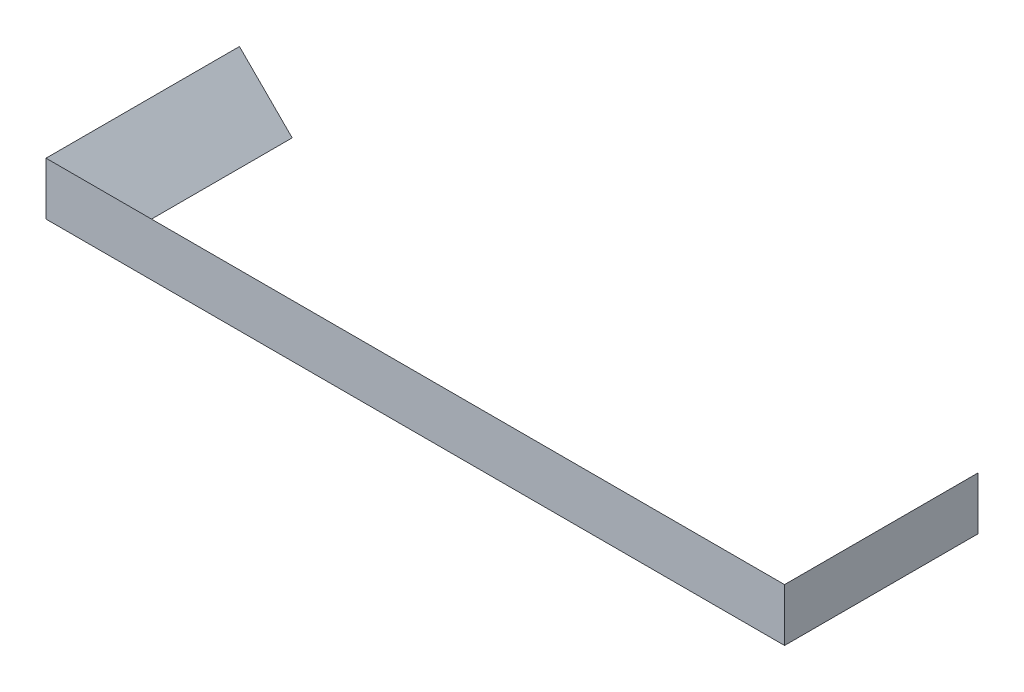
ISO-10303-21;
HEADER;
FILE_DESCRIPTION(('STEP AP214'),'2;1');
FILE_NAME('part.step','',(''),(''),'','','');
FILE_SCHEMA(('AUTOMOTIVE_DESIGN { 1 0 10303 214 1 1 1 1 }'));
ENDSEC;
DATA;
#1=APPLICATION_CONTEXT('core data for automotive mechanical design processes');
#2=APPLICATION_PROTOCOL_DEFINITION('international standard','automotive_design',2000,#1);
#3=PRODUCT_CONTEXT('',#1,'mechanical');
#4=PRODUCT('Part','Part','',(#3));
#5=PRODUCT_RELATED_PRODUCT_CATEGORY('part','',(#4));
#6=PRODUCT_DEFINITION_FORMATION('','',#4);
#7=PRODUCT_DEFINITION_CONTEXT('part definition',#1,'design');
#8=PRODUCT_DEFINITION('design','',#6,#7);
#9=PRODUCT_DEFINITION_SHAPE('','',#8);
#10=(LENGTH_UNIT() NAMED_UNIT(*) SI_UNIT(.MILLI.,.METRE.));
#11=(NAMED_UNIT(*) PLANE_ANGLE_UNIT() SI_UNIT($,.RADIAN.));
#12=(NAMED_UNIT(*) SI_UNIT($,.STERADIAN.) SOLID_ANGLE_UNIT());
#13=UNCERTAINTY_MEASURE_WITH_UNIT(LENGTH_MEASURE(1.E-05),#10,'distance_accuracy_value','');
#14=(GEOMETRIC_REPRESENTATION_CONTEXT(3) GLOBAL_UNCERTAINTY_ASSIGNED_CONTEXT((#13)) GLOBAL_UNIT_ASSIGNED_CONTEXT((#10,
#11,#12)) REPRESENTATION_CONTEXT('',''));
#15=CARTESIAN_POINT('',(0.,0.,0.));
#16=DIRECTION('',(0.,0.,1.));
#17=DIRECTION('',(1.,0.,0.));
#18=AXIS2_PLACEMENT_3D('',#15,#16,#17);
#19=CARTESIAN_POINT('',(84.,0.,22.));
#20=DIRECTION('',(-1.,0.,0.));
#21=DIRECTION('',(0.,0.,1.));
#22=AXIS2_PLACEMENT_3D('',#19,#20,#21);
#23=PLANE('',#22);
#24=DIRECTION('',(0.,-1.,0.));
#25=VECTOR('',#24,1.);
#26=CARTESIAN_POINT('',(84.,0.,0.));
#27=LINE('',#26,#25);
#28=CARTESIAN_POINT('',(84.,6.,0.));
#29=VERTEX_POINT('',#28);
#30=CARTESIAN_POINT('',(84.,0.,0.));
#31=VERTEX_POINT('',#30);
#32=EDGE_CURVE('E54',#29,#31,#27,.T.);
#33=ORIENTED_EDGE('',*,*,#32,.F.);
#34=DIRECTION('',(0.,0.,-1.));
#35=VECTOR('',#34,1.);
#36=CARTESIAN_POINT('',(84.,5.99999999999999,22.));
#37=LINE('',#36,#35);
#38=CARTESIAN_POINT('',(84.,5.99999999999999,22.));
#39=VERTEX_POINT('',#38);
#40=EDGE_CURVE('E134',#39,#29,#37,.T.);
#41=ORIENTED_EDGE('',*,*,#40,.F.);
#42=DIRECTION('',(0.,1.,0.));
#43=VECTOR('',#42,1.);
#44=CARTESIAN_POINT('',(84.,0.,22.));
#45=LINE('',#44,#43);
#46=CARTESIAN_POINT('',(84.,0.,22.));
#47=VERTEX_POINT('',#46);
#48=EDGE_CURVE('E130',#47,#39,#45,.T.);
#49=ORIENTED_EDGE('',*,*,#48,.F.);
#50=DIRECTION('',(0.,0.,-1.));
#51=VECTOR('',#50,1.);
#52=CARTESIAN_POINT('',(84.,0.,22.));
#53=LINE('',#52,#51);
#54=EDGE_CURVE('E131',#47,#31,#53,.T.);
#55=ORIENTED_EDGE('',*,*,#54,.T.);
#56=EDGE_LOOP('',(#33,#41,#49,#55));
#57=FACE_BOUND('',#56,.T.);
#58=ADVANCED_FACE('F38',(#57),#23,.F.);
#59=CARTESIAN_POINT('',(56.6094757082487,-21.3905242917513,-5.39052429175126));
#60=DIRECTION('',(0.707106781186548,-0.707106781186547,0.));
#61=DIRECTION('',(0.707106781186547,0.707106781186548,0.));
#62=AXIS2_PLACEMENT_3D('',#59,#60,#61);
#63=PLANE('',#62);
#64=DIRECTION('',(0.707106781186547,0.707106781186548,0.));
#65=VECTOR('',#64,1.);
#66=CARTESIAN_POINT('',(56.6094757082487,-21.3905242917513,0.));
#67=LINE('',#66,#65);
#68=CARTESIAN_POINT('',(78.,0.,0.));
#69=VERTEX_POINT('',#68);
#70=EDGE_CURVE('E12',#69,#29,#67,.T.);
#71=ORIENTED_EDGE('',*,*,#70,.F.);
#72=DIRECTION('',(0.,0.,-1.));
#73=VECTOR('',#72,1.);
#74=CARTESIAN_POINT('',(78.,0.,16.));
#75=LINE('',#74,#73);
#76=CARTESIAN_POINT('',(78.,0.,16.));
#77=VERTEX_POINT('',#76);
#78=EDGE_CURVE('E137',#77,#69,#75,.T.);
#79=ORIENTED_EDGE('',*,*,#78,.F.);
#80=DIRECTION('',(-0.577350269189626,-0.577350269189626,-0.577350269189626));
#81=VECTOR('',#80,1.);
#82=CARTESIAN_POINT('',(56.6094757082487,-21.3905242917513,-5.39052429175126));
#83=LINE('',#82,#81);
#84=EDGE_CURVE('E135',#39,#77,#83,.T.);
#85=ORIENTED_EDGE('',*,*,#84,.F.);
#86=ORIENTED_EDGE('',*,*,#40,.T.);
#87=EDGE_LOOP('',(#71,#79,#85,#86));
#88=FACE_BOUND('',#87,.T.);
#89=ADVANCED_FACE('F40',(#88),#63,.F.);
#90=CARTESIAN_POINT('',(0.,0.,22.));
#91=DIRECTION('',(0.,0.,1.));
#92=DIRECTION('',(1.,0.,0.));
#93=AXIS2_PLACEMENT_3D('',#90,#91,#92);
#94=PLANE('',#93);
#95=DIRECTION('',(1.,0.,0.));
#96=VECTOR('',#95,1.);
#97=CARTESIAN_POINT('',(0.,0.,22.));
#98=LINE('',#97,#96);
#99=CARTESIAN_POINT('',(0.,0.,22.));
#100=VERTEX_POINT('',#99);
#101=EDGE_CURVE('E127',#100,#47,#98,.T.);
#102=ORIENTED_EDGE('',*,*,#101,.T.);
#103=ORIENTED_EDGE('',*,*,#48,.T.);
#104=DIRECTION('',(1.,0.,0.));
#105=VECTOR('',#104,1.);
#106=CARTESIAN_POINT('',(0.,6.,22.));
#107=LINE('',#106,#105);
#108=CARTESIAN_POINT('',(0.,6.,22.));
#109=VERTEX_POINT('',#108);
#110=EDGE_CURVE('E121',#109,#39,#107,.T.);
#111=ORIENTED_EDGE('',*,*,#110,.F.);
#112=DIRECTION('',(0.,-1.,0.));
#113=VECTOR('',#112,1.);
#114=CARTESIAN_POINT('',(0.,0.,22.));
#115=LINE('',#114,#113);
#116=EDGE_CURVE('E95',#109,#100,#115,.T.);
#117=ORIENTED_EDGE('',*,*,#116,.T.);
#118=EDGE_LOOP('',(#102,#103,#111,#117));
#119=FACE_BOUND('',#118,.T.);
#120=ADVANCED_FACE('F147',(#119),#94,.T.);
#121=CARTESIAN_POINT('',(-1.82842712474618,7.82842712474619,23.8284271247462));
#122=DIRECTION('',(0.,0.707106781186547,-0.707106781186548));
#123=DIRECTION('',(0.,0.707106781186548,0.707106781186547));
#124=AXIS2_PLACEMENT_3D('',#121,#122,#123);
#125=PLANE('',#124);
#126=ORIENTED_EDGE('',*,*,#110,.T.);
#127=ORIENTED_EDGE('',*,*,#84,.T.);
#128=DIRECTION('',(1.,0.,0.));
#129=VECTOR('',#128,1.);
#130=CARTESIAN_POINT('',(6.,0.,16.));
#131=LINE('',#130,#129);
#132=CARTESIAN_POINT('',(6.,0.,16.));
#133=VERTEX_POINT('',#132);
#134=EDGE_CURVE('E124',#133,#77,#131,.T.);
#135=ORIENTED_EDGE('',*,*,#134,.F.);
#136=DIRECTION('',(-0.577350269189626,0.577350269189626,0.577350269189626));
#137=VECTOR('',#136,1.);
#138=CARTESIAN_POINT('',(-1.82842712474618,7.82842712474619,23.8284271247462));
#139=LINE('',#138,#137);
#140=EDGE_CURVE('E118',#133,#109,#139,.T.);
#141=ORIENTED_EDGE('',*,*,#140,.T.);
#142=EDGE_LOOP('',(#126,#127,#135,#141));
#143=FACE_BOUND('',#142,.T.);
#144=ADVANCED_FACE('F152',(#143),#125,.T.);
#145=CARTESIAN_POINT('',(0.,0.,27.4852813742386));
#146=DIRECTION('',(1.,0.,0.));
#147=DIRECTION('',(0.,0.,-1.));
#148=AXIS2_PLACEMENT_3D('',#145,#146,#147);
#149=PLANE('',#148);
#150=ORIENTED_EDGE('',*,*,#116,.F.);
#151=DIRECTION('',(0.,0.,-1.));
#152=VECTOR('',#151,1.);
#153=CARTESIAN_POINT('',(0.,6.,27.4852813742386));
#154=LINE('',#153,#152);
#155=CARTESIAN_POINT('',(0.,6.,0.));
#156=VERTEX_POINT('',#155);
#157=EDGE_CURVE('E88',#109,#156,#154,.T.);
#158=ORIENTED_EDGE('',*,*,#157,.T.);
#159=DIRECTION('',(0.,-1.,0.));
#160=VECTOR('',#159,1.);
#161=CARTESIAN_POINT('',(0.,0.,0.));
#162=LINE('',#161,#160);
#163=CARTESIAN_POINT('',(0.,0.,0.));
#164=VERTEX_POINT('',#163);
#165=EDGE_CURVE('E92',#156,#164,#162,.T.);
#166=ORIENTED_EDGE('',*,*,#165,.T.);
#167=DIRECTION('',(0.,0.,-1.));
#168=VECTOR('',#167,1.);
#169=CARTESIAN_POINT('',(0.,0.,27.4852813742386));
#170=LINE('',#169,#168);
#171=EDGE_CURVE('E99',#100,#164,#170,.T.);
#172=ORIENTED_EDGE('',*,*,#171,.F.);
#173=EDGE_LOOP('',(#150,#158,#166,#172));
#174=FACE_BOUND('',#173,.T.);
#175=ADVANCED_FACE('F90',(#174),#149,.F.);
#176=CARTESIAN_POINT('',(6.,0.,27.4852813742386));
#177=DIRECTION('',(0.,1.,0.));
#178=DIRECTION('',(-1.,0.,0.));
#179=AXIS2_PLACEMENT_3D('',#176,#177,#178);
#180=PLANE('',#179);
#181=DIRECTION('',(0.,0.,-1.));
#182=VECTOR('',#181,1.);
#183=CARTESIAN_POINT('',(6.,0.,27.4852813742386));
#184=LINE('',#183,#182);
#185=CARTESIAN_POINT('',(6.,0.,0.));
#186=VERTEX_POINT('',#185);
#187=EDGE_CURVE('E110',#133,#186,#184,.T.);
#188=ORIENTED_EDGE('',*,*,#187,.F.);
#189=ORIENTED_EDGE('',*,*,#134,.T.);
#190=ORIENTED_EDGE('',*,*,#78,.T.);
#191=DIRECTION('',(-1.,0.,0.));
#192=VECTOR('',#191,1.);
#193=CARTESIAN_POINT('',(42.,0.,0.));
#194=LINE('',#193,#192);
#195=EDGE_CURVE('E46',#31,#69,#194,.T.);
#196=ORIENTED_EDGE('',*,*,#195,.F.);
#197=ORIENTED_EDGE('',*,*,#54,.F.);
#198=ORIENTED_EDGE('',*,*,#101,.F.);
#199=ORIENTED_EDGE('',*,*,#171,.T.);
#200=DIRECTION('',(1.,0.,0.));
#201=VECTOR('',#200,1.);
#202=CARTESIAN_POINT('',(6.,0.,0.));
#203=LINE('',#202,#201);
#204=EDGE_CURVE('E106',#164,#186,#203,.T.);
#205=ORIENTED_EDGE('',*,*,#204,.T.);
#206=EDGE_LOOP('',(#188,#189,#190,#196,#197,#198,#199,#205));
#207=FACE_BOUND('',#206,.T.);
#208=ADVANCED_FACE('F153',(#207),#180,.F.);
#209=CARTESIAN_POINT('',(0.,6.,27.4852813742386));
#210=DIRECTION('',(-0.707106781186547,-0.707106781186547,0.));
#211=DIRECTION('',(0.707106781186548,-0.707106781186548,0.));
#212=AXIS2_PLACEMENT_3D('',#209,#210,#211);
#213=PLANE('',#212);
#214=ORIENTED_EDGE('',*,*,#140,.F.);
#215=ORIENTED_EDGE('',*,*,#187,.T.);
#216=DIRECTION('',(-0.707106781186548,0.707106781186548,0.));
#217=VECTOR('',#216,1.);
#218=CARTESIAN_POINT('',(0.,6.,0.));
#219=LINE('',#218,#217);
#220=EDGE_CURVE('E104',#186,#156,#219,.T.);
#221=ORIENTED_EDGE('',*,*,#220,.T.);
#222=ORIENTED_EDGE('',*,*,#157,.F.);
#223=EDGE_LOOP('',(#214,#215,#221,#222));
#224=FACE_BOUND('',#223,.T.);
#225=ADVANCED_FACE('F108',(#224),#213,.F.);
#226=CARTESIAN_POINT('',(6.,0.,0.));
#227=DIRECTION('',(0.,0.,-1.));
#228=DIRECTION('',(-1.,0.,0.));
#229=AXIS2_PLACEMENT_3D('',#226,#227,#228);
#230=PLANE('',#229);
#231=ORIENTED_EDGE('',*,*,#220,.F.);
#232=ORIENTED_EDGE('',*,*,#204,.F.);
#233=ORIENTED_EDGE('',*,*,#165,.F.);
#234=EDGE_LOOP('',(#231,#232,#233));
#235=FACE_BOUND('',#234,.T.);
#236=ADVANCED_FACE('F103',(#235),#230,.T.);
#237=CARTESIAN_POINT('',(81.,3.,0.));
#238=DIRECTION('',(0.,0.,-1.));
#239=DIRECTION('',(-1.,0.,0.));
#240=AXIS2_PLACEMENT_3D('',#237,#238,#239);
#241=PLANE('',#240);
#242=ORIENTED_EDGE('',*,*,#195,.T.);
#243=ORIENTED_EDGE('',*,*,#70,.T.);
#244=ORIENTED_EDGE('',*,*,#32,.T.);
#245=EDGE_LOOP('',(#242,#243,#244));
#246=FACE_BOUND('',#245,.T.);
#247=ADVANCED_FACE('F154',(#246),#241,.T.);
#248=CLOSED_SHELL('',(#58,#89,#120,#144,#175,#208,#225,#236,#247));
#249=MANIFOLD_SOLID_BREP('B2',#248);
#250=ADVANCED_BREP_SHAPE_REPRESENTATION('',(#18,#249),#14);
#251=SHAPE_DEFINITION_REPRESENTATION(#9,#250);
ENDSEC;
END-ISO-10303-21;
